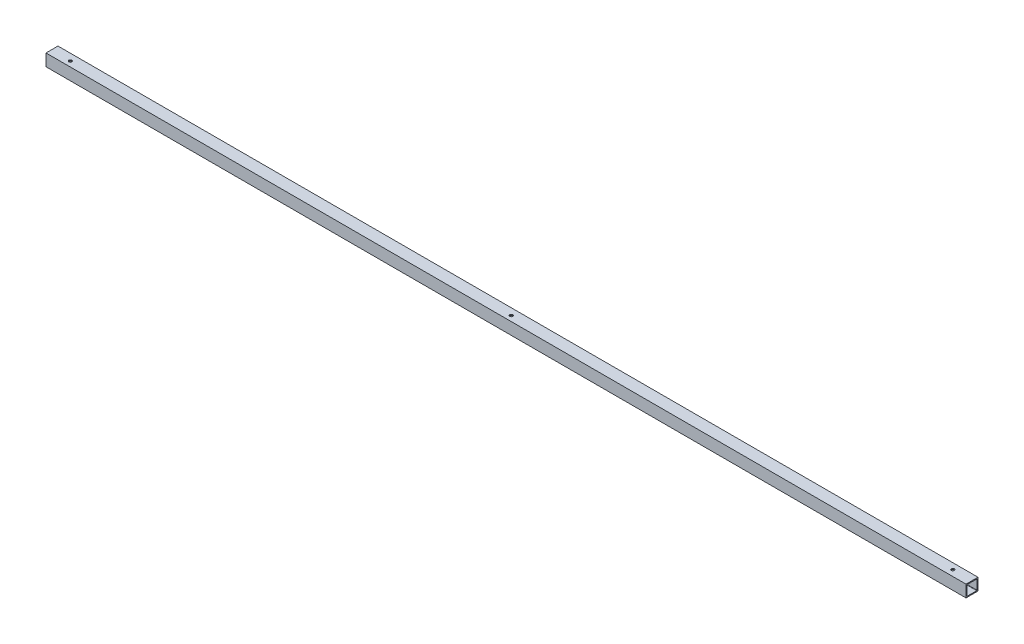
ISO-10303-21;
HEADER;
FILE_DESCRIPTION(('STEP AP214'),'2;1');
FILE_NAME('part.step','',(''),(''),'','','');
FILE_SCHEMA(('AUTOMOTIVE_DESIGN { 1 0 10303 214 1 1 1 1 }'));
ENDSEC;
DATA;
#1=APPLICATION_CONTEXT('core data for automotive mechanical design processes');
#2=APPLICATION_PROTOCOL_DEFINITION('international standard','automotive_design',2000,#1);
#3=PRODUCT_CONTEXT('',#1,'mechanical');
#4=PRODUCT('Part','Part','',(#3));
#5=PRODUCT_RELATED_PRODUCT_CATEGORY('part','',(#4));
#6=PRODUCT_DEFINITION_FORMATION('','',#4);
#7=PRODUCT_DEFINITION_CONTEXT('part definition',#1,'design');
#8=PRODUCT_DEFINITION('design','',#6,#7);
#9=PRODUCT_DEFINITION_SHAPE('','',#8);
#10=(LENGTH_UNIT() NAMED_UNIT(*) SI_UNIT(.MILLI.,.METRE.));
#11=(NAMED_UNIT(*) PLANE_ANGLE_UNIT() SI_UNIT($,.RADIAN.));
#12=(NAMED_UNIT(*) SI_UNIT($,.STERADIAN.) SOLID_ANGLE_UNIT());
#13=UNCERTAINTY_MEASURE_WITH_UNIT(LENGTH_MEASURE(1.E-05),#10,'distance_accuracy_value','');
#14=(GEOMETRIC_REPRESENTATION_CONTEXT(3) GLOBAL_UNCERTAINTY_ASSIGNED_CONTEXT((#13)) GLOBAL_UNIT_ASSIGNED_CONTEXT((#10,
#11,#12)) REPRESENTATION_CONTEXT('',''));
#15=CARTESIAN_POINT('',(0.,0.,0.));
#16=DIRECTION('',(0.,0.,1.));
#17=DIRECTION('',(1.,0.,0.));
#18=AXIS2_PLACEMENT_3D('',#15,#16,#17);
#19=CARTESIAN_POINT('',(1219.2,0.,0.));
#20=DIRECTION('',(-1.,0.,0.));
#21=DIRECTION('',(0.,0.,1.));
#22=AXIS2_PLACEMENT_3D('',#19,#20,#21);
#23=PLANE('',#22);
#24=DIRECTION('',(0.,-1.,0.));
#25=VECTOR('',#24,1.);
#26=CARTESIAN_POINT('',(1219.2,0.,0.));
#27=LINE('',#26,#25);
#28=CARTESIAN_POINT('',(1219.2,15.875,0.));
#29=VERTEX_POINT('',#28);
#30=CARTESIAN_POINT('',(1219.2,0.,0.));
#31=VERTEX_POINT('',#30);
#32=EDGE_CURVE('E192',#29,#31,#27,.T.);
#33=ORIENTED_EDGE('',*,*,#32,.T.);
#34=DIRECTION('',(0.,0.,-1.));
#35=VECTOR('',#34,1.);
#36=CARTESIAN_POINT('',(1219.2,0.,0.));
#37=LINE('',#36,#35);
#38=CARTESIAN_POINT('',(1219.2,0.,-15.875));
#39=VERTEX_POINT('',#38);
#40=EDGE_CURVE('E195',#31,#39,#37,.T.);
#41=ORIENTED_EDGE('',*,*,#40,.T.);
#42=DIRECTION('',(0.,1.,0.));
#43=VECTOR('',#42,1.);
#44=CARTESIAN_POINT('',(1219.2,0.,-15.875));
#45=LINE('',#44,#43);
#46=CARTESIAN_POINT('',(1219.2,15.875,-15.875));
#47=VERTEX_POINT('',#46);
#48=EDGE_CURVE('E198',#39,#47,#45,.T.);
#49=ORIENTED_EDGE('',*,*,#48,.T.);
#50=DIRECTION('',(0.,0.,1.));
#51=VECTOR('',#50,1.);
#52=CARTESIAN_POINT('',(1219.2,15.875,0.));
#53=LINE('',#52,#51);
#54=EDGE_CURVE('E200',#47,#29,#53,.T.);
#55=ORIENTED_EDGE('',*,*,#54,.T.);
#56=EDGE_LOOP('',(#33,#41,#49,#55));
#57=FACE_BOUND('',#56,.T.);
#58=CARTESIAN_POINT('',(1219.2,1.7446,-1.7446));
#59=DIRECTION('',(1.,0.,0.));
#60=DIRECTION('',(0.,0.,1.));
#61=AXIS2_PLACEMENT_3D('',#58,#59,#60);
#62=CIRCLE('',#61,0.499999999999999);
#63=CARTESIAN_POINT('',(1219.2,1.7446,-1.2446));
#64=VERTEX_POINT('',#63);
#65=CARTESIAN_POINT('',(1219.2,1.2446,-1.7446));
#66=VERTEX_POINT('',#65);
#67=EDGE_CURVE('E125',#64,#66,#62,.T.);
#68=ORIENTED_EDGE('',*,*,#67,.F.);
#69=DIRECTION('',(0.,-1.,0.));
#70=VECTOR('',#69,1.);
#71=CARTESIAN_POINT('',(1219.2,1.7446,-1.2446));
#72=LINE('',#71,#70);
#73=CARTESIAN_POINT('',(1219.2,14.1304,-1.2446));
#74=VERTEX_POINT('',#73);
#75=EDGE_CURVE('E159',#74,#64,#72,.T.);
#76=ORIENTED_EDGE('',*,*,#75,.F.);
#77=CARTESIAN_POINT('',(1219.2,14.1304,-1.7446));
#78=DIRECTION('',(1.,0.,0.));
#79=DIRECTION('',(0.,0.,1.));
#80=AXIS2_PLACEMENT_3D('',#77,#78,#79);
#81=CIRCLE('',#80,0.500000000000001);
#82=CARTESIAN_POINT('',(1219.2,14.6304,-1.7446));
#83=VERTEX_POINT('',#82);
#84=EDGE_CURVE('E157',#83,#74,#81,.T.);
#85=ORIENTED_EDGE('',*,*,#84,.F.);
#86=DIRECTION('',(0.,0.,1.));
#87=VECTOR('',#86,1.);
#88=CARTESIAN_POINT('',(1219.2,14.6304,-1.7446));
#89=LINE('',#88,#87);
#90=CARTESIAN_POINT('',(1219.2,14.6304,-14.1304));
#91=VERTEX_POINT('',#90);
#92=EDGE_CURVE('E155',#91,#83,#89,.T.);
#93=ORIENTED_EDGE('',*,*,#92,.F.);
#94=CARTESIAN_POINT('',(1219.2,14.1304,-14.1304));
#95=DIRECTION('',(1.,0.,0.));
#96=DIRECTION('',(0.,0.,1.));
#97=AXIS2_PLACEMENT_3D('',#94,#95,#96);
#98=CIRCLE('',#97,0.5);
#99=CARTESIAN_POINT('',(1219.2,14.1304,-14.6304));
#100=VERTEX_POINT('',#99);
#101=EDGE_CURVE('E153',#100,#91,#98,.T.);
#102=ORIENTED_EDGE('',*,*,#101,.F.);
#103=DIRECTION('',(0.,1.,0.));
#104=VECTOR('',#103,1.);
#105=CARTESIAN_POINT('',(1219.2,1.7446,-14.6304));
#106=LINE('',#105,#104);
#107=CARTESIAN_POINT('',(1219.2,1.7446,-14.6304));
#108=VERTEX_POINT('',#107);
#109=EDGE_CURVE('E148',#108,#100,#106,.T.);
#110=ORIENTED_EDGE('',*,*,#109,.F.);
#111=CARTESIAN_POINT('',(1219.2,1.7446,-14.1304));
#112=DIRECTION('',(1.,0.,0.));
#113=DIRECTION('',(0.,0.,-1.));
#114=AXIS2_PLACEMENT_3D('',#111,#112,#113);
#115=CIRCLE('',#114,0.5);
#116=CARTESIAN_POINT('',(1219.2,1.2446,-14.1304));
#117=VERTEX_POINT('',#116);
#118=EDGE_CURVE('E146',#117,#108,#115,.T.);
#119=ORIENTED_EDGE('',*,*,#118,.F.);
#120=DIRECTION('',(0.,0.,-1.));
#121=VECTOR('',#120,1.);
#122=CARTESIAN_POINT('',(1219.2,1.2446,-1.7446));
#123=LINE('',#122,#121);
#124=EDGE_CURVE('E133',#66,#117,#123,.T.);
#125=ORIENTED_EDGE('',*,*,#124,.F.);
#126=EDGE_LOOP('',(#68,#76,#85,#93,#102,#110,#119,#125));
#127=FACE_BOUND('',#126,.T.);
#128=ADVANCED_FACE('F34',(#57,#127),#23,.F.);
#129=CARTESIAN_POINT('',(0.,0.,0.));
#130=DIRECTION('',(-1.,0.,0.));
#131=DIRECTION('',(0.,0.,1.));
#132=AXIS2_PLACEMENT_3D('',#129,#130,#131);
#133=PLANE('',#132);
#134=DIRECTION('',(0.,-1.,0.));
#135=VECTOR('',#134,1.);
#136=CARTESIAN_POINT('',(0.,0.,0.));
#137=LINE('',#136,#135);
#138=CARTESIAN_POINT('',(0.,15.875,0.));
#139=VERTEX_POINT('',#138);
#140=CARTESIAN_POINT('',(0.,0.,0.));
#141=VERTEX_POINT('',#140);
#142=EDGE_CURVE('E141',#139,#141,#137,.T.);
#143=ORIENTED_EDGE('',*,*,#142,.F.);
#144=DIRECTION('',(0.,0.,1.));
#145=VECTOR('',#144,1.);
#146=CARTESIAN_POINT('',(0.,15.875,0.));
#147=LINE('',#146,#145);
#148=CARTESIAN_POINT('',(0.,15.875,-15.875));
#149=VERTEX_POINT('',#148);
#150=EDGE_CURVE('E196',#149,#139,#147,.T.);
#151=ORIENTED_EDGE('',*,*,#150,.F.);
#152=DIRECTION('',(0.,1.,0.));
#153=VECTOR('',#152,1.);
#154=CARTESIAN_POINT('',(0.,0.,-15.875));
#155=LINE('',#154,#153);
#156=CARTESIAN_POINT('',(0.,0.,-15.875));
#157=VERTEX_POINT('',#156);
#158=EDGE_CURVE('E207',#157,#149,#155,.T.);
#159=ORIENTED_EDGE('',*,*,#158,.F.);
#160=DIRECTION('',(0.,0.,-1.));
#161=VECTOR('',#160,1.);
#162=CARTESIAN_POINT('',(0.,0.,0.));
#163=LINE('',#162,#161);
#164=EDGE_CURVE('E205',#141,#157,#163,.T.);
#165=ORIENTED_EDGE('',*,*,#164,.F.);
#166=EDGE_LOOP('',(#143,#151,#159,#165));
#167=FACE_BOUND('',#166,.T.);
#168=DIRECTION('',(0.,-1.,0.));
#169=VECTOR('',#168,1.);
#170=CARTESIAN_POINT('',(0.,1.7446,-1.2446));
#171=LINE('',#170,#169);
#172=CARTESIAN_POINT('',(0.,14.1304,-1.2446));
#173=VERTEX_POINT('',#172);
#174=CARTESIAN_POINT('',(0.,1.7446,-1.2446));
#175=VERTEX_POINT('',#174);
#176=EDGE_CURVE('E134',#173,#175,#171,.T.);
#177=ORIENTED_EDGE('',*,*,#176,.T.);
#178=CARTESIAN_POINT('',(0.,1.7446,-1.7446));
#179=DIRECTION('',(1.,0.,0.));
#180=DIRECTION('',(0.,0.,1.));
#181=AXIS2_PLACEMENT_3D('',#178,#179,#180);
#182=CIRCLE('',#181,0.499999999999999);
#183=CARTESIAN_POINT('',(0.,1.2446,-1.7446));
#184=VERTEX_POINT('',#183);
#185=EDGE_CURVE('E59',#175,#184,#182,.T.);
#186=ORIENTED_EDGE('',*,*,#185,.T.);
#187=DIRECTION('',(0.,0.,-1.));
#188=VECTOR('',#187,1.);
#189=CARTESIAN_POINT('',(0.,1.2446,-1.7446));
#190=LINE('',#189,#188);
#191=CARTESIAN_POINT('',(0.,1.2446,-14.1304));
#192=VERTEX_POINT('',#191);
#193=EDGE_CURVE('E140',#184,#192,#190,.T.);
#194=ORIENTED_EDGE('',*,*,#193,.T.);
#195=CARTESIAN_POINT('',(0.,1.7446,-14.1304));
#196=DIRECTION('',(1.,0.,0.));
#197=DIRECTION('',(0.,0.,-1.));
#198=AXIS2_PLACEMENT_3D('',#195,#196,#197);
#199=CIRCLE('',#198,0.5);
#200=CARTESIAN_POINT('',(0.,1.7446,-14.6304));
#201=VERTEX_POINT('',#200);
#202=EDGE_CURVE('E164',#192,#201,#199,.T.);
#203=ORIENTED_EDGE('',*,*,#202,.T.);
#204=DIRECTION('',(0.,1.,0.));
#205=VECTOR('',#204,1.);
#206=CARTESIAN_POINT('',(0.,1.7446,-14.6304));
#207=LINE('',#206,#205);
#208=CARTESIAN_POINT('',(0.,14.1304,-14.6304));
#209=VERTEX_POINT('',#208);
#210=EDGE_CURVE('E167',#201,#209,#207,.T.);
#211=ORIENTED_EDGE('',*,*,#210,.T.);
#212=CARTESIAN_POINT('',(0.,14.1304,-14.1304));
#213=DIRECTION('',(1.,0.,0.));
#214=DIRECTION('',(0.,0.,1.));
#215=AXIS2_PLACEMENT_3D('',#212,#213,#214);
#216=CIRCLE('',#215,0.5);
#217=CARTESIAN_POINT('',(0.,14.6304,-14.1304));
#218=VERTEX_POINT('',#217);
#219=EDGE_CURVE('E170',#209,#218,#216,.T.);
#220=ORIENTED_EDGE('',*,*,#219,.T.);
#221=DIRECTION('',(0.,0.,1.));
#222=VECTOR('',#221,1.);
#223=CARTESIAN_POINT('',(0.,14.6304,-1.7446));
#224=LINE('',#223,#222);
#225=CARTESIAN_POINT('',(0.,14.6304,-1.7446));
#226=VERTEX_POINT('',#225);
#227=EDGE_CURVE('E173',#218,#226,#224,.T.);
#228=ORIENTED_EDGE('',*,*,#227,.T.);
#229=CARTESIAN_POINT('',(0.,14.1304,-1.7446));
#230=DIRECTION('',(1.,0.,0.));
#231=DIRECTION('',(0.,0.,1.));
#232=AXIS2_PLACEMENT_3D('',#229,#230,#231);
#233=CIRCLE('',#232,0.500000000000001);
#234=EDGE_CURVE('E176',#226,#173,#233,.T.);
#235=ORIENTED_EDGE('',*,*,#234,.T.);
#236=EDGE_LOOP('',(#177,#186,#194,#203,#211,#220,#228,#235));
#237=FACE_BOUND('',#236,.T.);
#238=ADVANCED_FACE('F260',(#167,#237),#133,.T.);
#239=CARTESIAN_POINT('',(1219.2,0.,0.));
#240=DIRECTION('',(0.,0.,-1.));
#241=DIRECTION('',(-1.,0.,0.));
#242=AXIS2_PLACEMENT_3D('',#239,#240,#241);
#243=PLANE('',#242);
#244=ORIENTED_EDGE('',*,*,#142,.T.);
#245=DIRECTION('',(-1.,0.,0.));
#246=VECTOR('',#245,1.);
#247=CARTESIAN_POINT('',(1219.2,0.,0.));
#248=LINE('',#247,#246);
#249=EDGE_CURVE('E11',#31,#141,#248,.T.);
#250=ORIENTED_EDGE('',*,*,#249,.F.);
#251=ORIENTED_EDGE('',*,*,#32,.F.);
#252=DIRECTION('',(-1.,0.,0.));
#253=VECTOR('',#252,1.);
#254=CARTESIAN_POINT('',(1219.2,15.875,0.));
#255=LINE('',#254,#253);
#256=EDGE_CURVE('E202',#29,#139,#255,.T.);
#257=ORIENTED_EDGE('',*,*,#256,.T.);
#258=EDGE_LOOP('',(#244,#250,#251,#257));
#259=FACE_BOUND('',#258,.T.);
#260=ADVANCED_FACE('F36',(#259),#243,.F.);
#261=CARTESIAN_POINT('',(1219.2,0.,0.));
#262=DIRECTION('',(0.,1.,0.));
#263=DIRECTION('',(0.,0.,1.));
#264=AXIS2_PLACEMENT_3D('',#261,#262,#263);
#265=PLANE('',#264);
#266=CARTESIAN_POINT('',(1193.8,0.,-7.9375));
#267=DIRECTION('',(0.,1.,0.));
#268=DIRECTION('',(0.,0.,1.));
#269=AXIS2_PLACEMENT_3D('',#266,#267,#268);
#270=CIRCLE('',#269,2.0000000000001);
#271=CARTESIAN_POINT('',(1193.8,0.,-5.9374999999999));
#272=VERTEX_POINT('',#271);
#273=EDGE_CURVE('E308',#272,#272,#270,.T.);
#274=ORIENTED_EDGE('',*,*,#273,.T.);
#275=EDGE_LOOP('',(#274));
#276=FACE_BOUND('',#275,.T.);
#277=CARTESIAN_POINT('',(25.4000000000001,0.,-6.875));
#278=DIRECTION('',(0.,1.,0.));
#279=DIRECTION('',(0.,0.,1.));
#280=AXIS2_PLACEMENT_3D('',#277,#278,#279);
#281=CIRCLE('',#280,2.);
#282=CARTESIAN_POINT('',(25.4000000000001,0.,-4.87500000000001));
#283=VERTEX_POINT('',#282);
#284=EDGE_CURVE('E312',#283,#283,#281,.T.);
#285=ORIENTED_EDGE('',*,*,#284,.T.);
#286=EDGE_LOOP('',(#285));
#287=FACE_BOUND('',#286,.T.);
#288=CARTESIAN_POINT('',(609.600483099217,0.,-6.875));
#289=DIRECTION('',(0.,1.,0.));
#290=DIRECTION('',(0.,0.,1.));
#291=AXIS2_PLACEMENT_3D('',#288,#289,#290);
#292=CIRCLE('',#291,2.);
#293=CARTESIAN_POINT('',(609.600483099217,0.,-4.875));
#294=VERTEX_POINT('',#293);
#295=EDGE_CURVE('E220',#294,#294,#292,.T.);
#296=ORIENTED_EDGE('',*,*,#295,.T.);
#297=EDGE_LOOP('',(#296));
#298=FACE_BOUND('',#297,.T.);
#299=ORIENTED_EDGE('',*,*,#164,.T.);
#300=DIRECTION('',(-1.,0.,0.));
#301=VECTOR('',#300,1.);
#302=CARTESIAN_POINT('',(1219.2,0.,-15.875));
#303=LINE('',#302,#301);
#304=EDGE_CURVE('E43',#39,#157,#303,.T.);
#305=ORIENTED_EDGE('',*,*,#304,.F.);
#306=ORIENTED_EDGE('',*,*,#40,.F.);
#307=ORIENTED_EDGE('',*,*,#249,.T.);
#308=EDGE_LOOP('',(#299,#305,#306,#307));
#309=FACE_BOUND('',#308,.T.);
#310=ADVANCED_FACE('F297',(#276,#287,#298,#309),#265,.F.);
#311=CARTESIAN_POINT('',(1219.2,0.,-15.875));
#312=DIRECTION('',(0.,0.,1.));
#313=DIRECTION('',(1.,0.,0.));
#314=AXIS2_PLACEMENT_3D('',#311,#312,#313);
#315=PLANE('',#314);
#316=ORIENTED_EDGE('',*,*,#158,.T.);
#317=DIRECTION('',(-1.,0.,0.));
#318=VECTOR('',#317,1.);
#319=CARTESIAN_POINT('',(1219.2,15.875,-15.875));
#320=LINE('',#319,#318);
#321=EDGE_CURVE('E212',#47,#149,#320,.T.);
#322=ORIENTED_EDGE('',*,*,#321,.F.);
#323=ORIENTED_EDGE('',*,*,#48,.F.);
#324=ORIENTED_EDGE('',*,*,#304,.T.);
#325=EDGE_LOOP('',(#316,#322,#323,#324));
#326=FACE_BOUND('',#325,.T.);
#327=ADVANCED_FACE('F294',(#326),#315,.F.);
#328=CARTESIAN_POINT('',(1219.2,15.875,0.));
#329=DIRECTION('',(0.,-1.,0.));
#330=DIRECTION('',(0.,0.,-1.));
#331=AXIS2_PLACEMENT_3D('',#328,#329,#330);
#332=PLANE('',#331);
#333=CARTESIAN_POINT('',(1193.8,15.875,-7.9375));
#334=DIRECTION('',(0.,1.,0.));
#335=DIRECTION('',(0.,0.,1.));
#336=AXIS2_PLACEMENT_3D('',#333,#334,#335);
#337=CIRCLE('',#336,2.0000000000001);
#338=CARTESIAN_POINT('',(1193.8,15.875,-5.9374999999999));
#339=VERTEX_POINT('',#338);
#340=EDGE_CURVE('E330',#339,#339,#337,.T.);
#341=ORIENTED_EDGE('',*,*,#340,.F.);
#342=EDGE_LOOP('',(#341));
#343=FACE_BOUND('',#342,.T.);
#344=CARTESIAN_POINT('',(25.4000000000001,15.875,-6.875));
#345=DIRECTION('',(0.,1.,0.));
#346=DIRECTION('',(0.,0.,1.));
#347=AXIS2_PLACEMENT_3D('',#344,#345,#346);
#348=CIRCLE('',#347,2.);
#349=CARTESIAN_POINT('',(25.4000000000001,15.875,-4.87500000000001));
#350=VERTEX_POINT('',#349);
#351=EDGE_CURVE('E334',#350,#350,#348,.T.);
#352=ORIENTED_EDGE('',*,*,#351,.F.);
#353=EDGE_LOOP('',(#352));
#354=FACE_BOUND('',#353,.T.);
#355=CARTESIAN_POINT('',(609.600483099217,15.875,-6.875));
#356=DIRECTION('',(0.,1.,0.));
#357=DIRECTION('',(0.,0.,1.));
#358=AXIS2_PLACEMENT_3D('',#355,#356,#357);
#359=CIRCLE('',#358,2.);
#360=CARTESIAN_POINT('',(609.600483099217,15.875,-4.875));
#361=VERTEX_POINT('',#360);
#362=EDGE_CURVE('E233',#361,#361,#359,.T.);
#363=ORIENTED_EDGE('',*,*,#362,.F.);
#364=EDGE_LOOP('',(#363));
#365=FACE_BOUND('',#364,.T.);
#366=ORIENTED_EDGE('',*,*,#150,.T.);
#367=ORIENTED_EDGE('',*,*,#256,.F.);
#368=ORIENTED_EDGE('',*,*,#54,.F.);
#369=ORIENTED_EDGE('',*,*,#321,.T.);
#370=EDGE_LOOP('',(#366,#367,#368,#369));
#371=FACE_BOUND('',#370,.T.);
#372=ADVANCED_FACE('F291',(#343,#354,#365,#371),#332,.F.);
#373=CARTESIAN_POINT('',(1219.2,1.7446,-1.7446));
#374=DIRECTION('',(-1.,0.,0.));
#375=DIRECTION('',(0.,0.,1.));
#376=AXIS2_PLACEMENT_3D('',#373,#374,#375);
#377=CYLINDRICAL_SURFACE('',#376,0.499999999999999);
#378=ORIENTED_EDGE('',*,*,#185,.F.);
#379=DIRECTION('',(-1.,0.,0.));
#380=VECTOR('',#379,1.);
#381=CARTESIAN_POINT('',(1219.2,1.7446,-1.2446));
#382=LINE('',#381,#380);
#383=EDGE_CURVE('E129',#64,#175,#382,.T.);
#384=ORIENTED_EDGE('',*,*,#383,.F.);
#385=ORIENTED_EDGE('',*,*,#67,.T.);
#386=DIRECTION('',(-1.,0.,0.));
#387=VECTOR('',#386,1.);
#388=CARTESIAN_POINT('',(1219.2,1.2446,-1.7446));
#389=LINE('',#388,#387);
#390=EDGE_CURVE('E128',#66,#184,#389,.T.);
#391=ORIENTED_EDGE('',*,*,#390,.T.);
#392=EDGE_LOOP('',(#378,#384,#385,#391));
#393=FACE_BOUND('',#392,.T.);
#394=ADVANCED_FACE('F127',(#393),#377,.F.);
#395=CARTESIAN_POINT('',(1219.2,1.2446,-1.7446));
#396=DIRECTION('',(0.,1.,0.));
#397=DIRECTION('',(0.,0.,1.));
#398=AXIS2_PLACEMENT_3D('',#395,#396,#397);
#399=PLANE('',#398);
#400=CARTESIAN_POINT('',(1193.8,1.2446,-7.9375));
#401=DIRECTION('',(0.,1.,0.));
#402=DIRECTION('',(0.,0.,1.));
#403=AXIS2_PLACEMENT_3D('',#400,#401,#402);
#404=CIRCLE('',#403,2.0000000000001);
#405=CARTESIAN_POINT('',(1193.8,1.2446,-5.9374999999999));
#406=VERTEX_POINT('',#405);
#407=EDGE_CURVE('E162',#406,#406,#404,.T.);
#408=ORIENTED_EDGE('',*,*,#407,.F.);
#409=EDGE_LOOP('',(#408));
#410=FACE_BOUND('',#409,.T.);
#411=CARTESIAN_POINT('',(25.4000000000001,1.2446,-6.875));
#412=DIRECTION('',(0.,1.,0.));
#413=DIRECTION('',(0.,0.,1.));
#414=AXIS2_PLACEMENT_3D('',#411,#412,#413);
#415=CIRCLE('',#414,2.);
#416=CARTESIAN_POINT('',(25.4000000000001,1.2446,-4.87500000000001));
#417=VERTEX_POINT('',#416);
#418=EDGE_CURVE('E223',#417,#417,#415,.T.);
#419=ORIENTED_EDGE('',*,*,#418,.F.);
#420=EDGE_LOOP('',(#419));
#421=FACE_BOUND('',#420,.T.);
#422=CARTESIAN_POINT('',(609.600483099217,1.2446,-6.875));
#423=DIRECTION('',(0.,1.,0.));
#424=DIRECTION('',(0.,0.,1.));
#425=AXIS2_PLACEMENT_3D('',#422,#423,#424);
#426=CIRCLE('',#425,2.);
#427=CARTESIAN_POINT('',(609.600483099217,1.2446,-4.875));
#428=VERTEX_POINT('',#427);
#429=EDGE_CURVE('E219',#428,#428,#426,.T.);
#430=ORIENTED_EDGE('',*,*,#429,.F.);
#431=EDGE_LOOP('',(#430));
#432=FACE_BOUND('',#431,.T.);
#433=ORIENTED_EDGE('',*,*,#193,.F.);
#434=ORIENTED_EDGE('',*,*,#390,.F.);
#435=ORIENTED_EDGE('',*,*,#124,.T.);
#436=DIRECTION('',(-1.,0.,0.));
#437=VECTOR('',#436,1.);
#438=CARTESIAN_POINT('',(1219.2,1.2446,-14.1304));
#439=LINE('',#438,#437);
#440=EDGE_CURVE('E142',#117,#192,#439,.T.);
#441=ORIENTED_EDGE('',*,*,#440,.T.);
#442=EDGE_LOOP('',(#433,#434,#435,#441));
#443=FACE_BOUND('',#442,.T.);
#444=ADVANCED_FACE('F137',(#410,#421,#432,#443),#399,.T.);
#445=CARTESIAN_POINT('',(1219.2,1.7446,-14.1304));
#446=DIRECTION('',(-1.,0.,0.));
#447=DIRECTION('',(0.,0.,1.));
#448=AXIS2_PLACEMENT_3D('',#445,#446,#447);
#449=CYLINDRICAL_SURFACE('',#448,0.5);
#450=ORIENTED_EDGE('',*,*,#202,.F.);
#451=ORIENTED_EDGE('',*,*,#440,.F.);
#452=ORIENTED_EDGE('',*,*,#118,.T.);
#453=DIRECTION('',(-1.,0.,0.));
#454=VECTOR('',#453,1.);
#455=CARTESIAN_POINT('',(1219.2,1.7446,-14.6304));
#456=LINE('',#455,#454);
#457=EDGE_CURVE('E189',#108,#201,#456,.T.);
#458=ORIENTED_EDGE('',*,*,#457,.T.);
#459=EDGE_LOOP('',(#450,#451,#452,#458));
#460=FACE_BOUND('',#459,.T.);
#461=ADVANCED_FACE('F362',(#460),#449,.F.);
#462=CARTESIAN_POINT('',(1219.2,1.7446,-14.6304));
#463=DIRECTION('',(0.,0.,1.));
#464=DIRECTION('',(1.,0.,0.));
#465=AXIS2_PLACEMENT_3D('',#462,#463,#464);
#466=PLANE('',#465);
#467=ORIENTED_EDGE('',*,*,#210,.F.);
#468=ORIENTED_EDGE('',*,*,#457,.F.);
#469=ORIENTED_EDGE('',*,*,#109,.T.);
#470=DIRECTION('',(-1.,0.,0.));
#471=VECTOR('',#470,1.);
#472=CARTESIAN_POINT('',(1219.2,14.1304,-14.6304));
#473=LINE('',#472,#471);
#474=EDGE_CURVE('E187',#100,#209,#473,.T.);
#475=ORIENTED_EDGE('',*,*,#474,.T.);
#476=EDGE_LOOP('',(#467,#468,#469,#475));
#477=FACE_BOUND('',#476,.T.);
#478=ADVANCED_FACE('F368',(#477),#466,.T.);
#479=CARTESIAN_POINT('',(1219.2,14.1304,-14.1304));
#480=DIRECTION('',(-1.,0.,0.));
#481=DIRECTION('',(0.,0.,1.));
#482=AXIS2_PLACEMENT_3D('',#479,#480,#481);
#483=CYLINDRICAL_SURFACE('',#482,0.5);
#484=ORIENTED_EDGE('',*,*,#219,.F.);
#485=ORIENTED_EDGE('',*,*,#474,.F.);
#486=ORIENTED_EDGE('',*,*,#101,.T.);
#487=DIRECTION('',(-1.,0.,0.));
#488=VECTOR('',#487,1.);
#489=CARTESIAN_POINT('',(1219.2,14.6304,-14.1304));
#490=LINE('',#489,#488);
#491=EDGE_CURVE('E185',#91,#218,#490,.T.);
#492=ORIENTED_EDGE('',*,*,#491,.T.);
#493=EDGE_LOOP('',(#484,#485,#486,#492));
#494=FACE_BOUND('',#493,.T.);
#495=ADVANCED_FACE('F248',(#494),#483,.F.);
#496=CARTESIAN_POINT('',(1219.2,14.6304,-1.7446));
#497=DIRECTION('',(0.,-1.,0.));
#498=DIRECTION('',(0.,0.,-1.));
#499=AXIS2_PLACEMENT_3D('',#496,#497,#498);
#500=PLANE('',#499);
#501=CARTESIAN_POINT('',(1193.8,14.6304,-7.9375));
#502=DIRECTION('',(0.,-1.,0.));
#503=DIRECTION('',(0.,0.,-1.));
#504=AXIS2_PLACEMENT_3D('',#501,#502,#503);
#505=CIRCLE('',#504,2.0000000000001);
#506=CARTESIAN_POINT('',(1193.8,14.6304,-9.9375000000001));
#507=VERTEX_POINT('',#506);
#508=EDGE_CURVE('E38',#507,#507,#505,.T.);
#509=ORIENTED_EDGE('',*,*,#508,.F.);
#510=EDGE_LOOP('',(#509));
#511=FACE_BOUND('',#510,.T.);
#512=CARTESIAN_POINT('',(25.4000000000001,14.6304,-6.875));
#513=DIRECTION('',(0.,-1.,0.));
#514=DIRECTION('',(0.,0.,-1.));
#515=AXIS2_PLACEMENT_3D('',#512,#513,#514);
#516=CIRCLE('',#515,2.);
#517=CARTESIAN_POINT('',(25.4000000000001,14.6304,-8.875));
#518=VERTEX_POINT('',#517);
#519=EDGE_CURVE('E221',#518,#518,#516,.T.);
#520=ORIENTED_EDGE('',*,*,#519,.F.);
#521=EDGE_LOOP('',(#520));
#522=FACE_BOUND('',#521,.T.);
#523=CARTESIAN_POINT('',(609.600483099217,14.6304,-6.875));
#524=DIRECTION('',(0.,-1.,0.));
#525=DIRECTION('',(0.,0.,-1.));
#526=AXIS2_PLACEMENT_3D('',#523,#524,#525);
#527=CIRCLE('',#526,2.);
#528=CARTESIAN_POINT('',(609.600483099217,14.6304,-8.875));
#529=VERTEX_POINT('',#528);
#530=EDGE_CURVE('E217',#529,#529,#527,.T.);
#531=ORIENTED_EDGE('',*,*,#530,.F.);
#532=EDGE_LOOP('',(#531));
#533=FACE_BOUND('',#532,.T.);
#534=ORIENTED_EDGE('',*,*,#227,.F.);
#535=ORIENTED_EDGE('',*,*,#491,.F.);
#536=ORIENTED_EDGE('',*,*,#92,.T.);
#537=DIRECTION('',(-1.,0.,0.));
#538=VECTOR('',#537,1.);
#539=CARTESIAN_POINT('',(1219.2,14.6304,-1.7446));
#540=LINE('',#539,#538);
#541=EDGE_CURVE('E183',#83,#226,#540,.T.);
#542=ORIENTED_EDGE('',*,*,#541,.T.);
#543=EDGE_LOOP('',(#534,#535,#536,#542));
#544=FACE_BOUND('',#543,.T.);
#545=ADVANCED_FACE('F244',(#511,#522,#533,#544),#500,.T.);
#546=CARTESIAN_POINT('',(1219.2,14.1304,-1.7446));
#547=DIRECTION('',(-1.,0.,0.));
#548=DIRECTION('',(0.,0.,1.));
#549=AXIS2_PLACEMENT_3D('',#546,#547,#548);
#550=CYLINDRICAL_SURFACE('',#549,0.500000000000001);
#551=ORIENTED_EDGE('',*,*,#234,.F.);
#552=ORIENTED_EDGE('',*,*,#541,.F.);
#553=ORIENTED_EDGE('',*,*,#84,.T.);
#554=DIRECTION('',(-1.,0.,0.));
#555=VECTOR('',#554,1.);
#556=CARTESIAN_POINT('',(1219.2,14.1304,-1.2446));
#557=LINE('',#556,#555);
#558=EDGE_CURVE('E51',#74,#173,#557,.T.);
#559=ORIENTED_EDGE('',*,*,#558,.T.);
#560=EDGE_LOOP('',(#551,#552,#553,#559));
#561=FACE_BOUND('',#560,.T.);
#562=ADVANCED_FACE('F247',(#561),#550,.F.);
#563=CARTESIAN_POINT('',(1219.2,1.7446,-1.2446));
#564=DIRECTION('',(0.,0.,-1.));
#565=DIRECTION('',(-1.,0.,0.));
#566=AXIS2_PLACEMENT_3D('',#563,#564,#565);
#567=PLANE('',#566);
#568=ORIENTED_EDGE('',*,*,#176,.F.);
#569=ORIENTED_EDGE('',*,*,#558,.F.);
#570=ORIENTED_EDGE('',*,*,#75,.T.);
#571=ORIENTED_EDGE('',*,*,#383,.T.);
#572=EDGE_LOOP('',(#568,#569,#570,#571));
#573=FACE_BOUND('',#572,.T.);
#574=ADVANCED_FACE('F267',(#573),#567,.T.);
#575=CARTESIAN_POINT('',(609.600483099217,0.,-6.875));
#576=DIRECTION('',(0.,1.,0.));
#577=DIRECTION('',(0.,0.,1.));
#578=AXIS2_PLACEMENT_3D('',#575,#576,#577);
#579=CYLINDRICAL_SURFACE('',#578,2.);
#580=ORIENTED_EDGE('',*,*,#530,.T.);
#581=EDGE_LOOP('',(#580));
#582=FACE_BOUND('',#581,.T.);
#583=ORIENTED_EDGE('',*,*,#362,.T.);
#584=EDGE_LOOP('',(#583));
#585=FACE_BOUND('',#584,.T.);
#586=ADVANCED_FACE('F269',(#582,#585),#579,.F.);
#587=CARTESIAN_POINT('',(25.4000000000001,0.,-6.875));
#588=DIRECTION('',(0.,1.,0.));
#589=DIRECTION('',(0.,0.,1.));
#590=AXIS2_PLACEMENT_3D('',#587,#588,#589);
#591=CYLINDRICAL_SURFACE('',#590,2.);
#592=ORIENTED_EDGE('',*,*,#519,.T.);
#593=EDGE_LOOP('',(#592));
#594=FACE_BOUND('',#593,.T.);
#595=ORIENTED_EDGE('',*,*,#351,.T.);
#596=EDGE_LOOP('',(#595));
#597=FACE_BOUND('',#596,.T.);
#598=ADVANCED_FACE('F275',(#594,#597),#591,.F.);
#599=CARTESIAN_POINT('',(1193.8,0.,-7.9375));
#600=DIRECTION('',(0.,1.,0.));
#601=DIRECTION('',(0.,0.,1.));
#602=AXIS2_PLACEMENT_3D('',#599,#600,#601);
#603=CYLINDRICAL_SURFACE('',#602,2.0000000000001);
#604=ORIENTED_EDGE('',*,*,#508,.T.);
#605=EDGE_LOOP('',(#604));
#606=FACE_BOUND('',#605,.T.);
#607=ORIENTED_EDGE('',*,*,#340,.T.);
#608=EDGE_LOOP('',(#607));
#609=FACE_BOUND('',#608,.T.);
#610=ADVANCED_FACE('F241',(#606,#609),#603,.F.);
#611=ORIENTED_EDGE('',*,*,#429,.T.);
#612=EDGE_LOOP('',(#611));
#613=FACE_BOUND('',#612,.T.);
#614=ORIENTED_EDGE('',*,*,#295,.F.);
#615=EDGE_LOOP('',(#614));
#616=FACE_BOUND('',#615,.T.);
#617=ADVANCED_FACE('F278',(#613,#616),#579,.F.);
#618=ORIENTED_EDGE('',*,*,#418,.T.);
#619=EDGE_LOOP('',(#618));
#620=FACE_BOUND('',#619,.T.);
#621=ORIENTED_EDGE('',*,*,#284,.F.);
#622=EDGE_LOOP('',(#621));
#623=FACE_BOUND('',#622,.T.);
#624=ADVANCED_FACE('F345',(#620,#623),#591,.F.);
#625=ORIENTED_EDGE('',*,*,#407,.T.);
#626=EDGE_LOOP('',(#625));
#627=FACE_BOUND('',#626,.T.);
#628=ORIENTED_EDGE('',*,*,#273,.F.);
#629=EDGE_LOOP('',(#628));
#630=FACE_BOUND('',#629,.T.);
#631=ADVANCED_FACE('F350',(#627,#630),#603,.F.);
#632=CLOSED_SHELL('',(#128,#238,#260,#310,#327,#372,#394,#444,#461,#478,#495,#545,#562,#574,
#586,#598,#610,#617,#624,#631));
#633=MANIFOLD_SOLID_BREP('B2',#632);
#634=ADVANCED_BREP_SHAPE_REPRESENTATION('',(#18,#633),#14);
#635=SHAPE_DEFINITION_REPRESENTATION(#9,#634);
ENDSEC;
END-ISO-10303-21;
